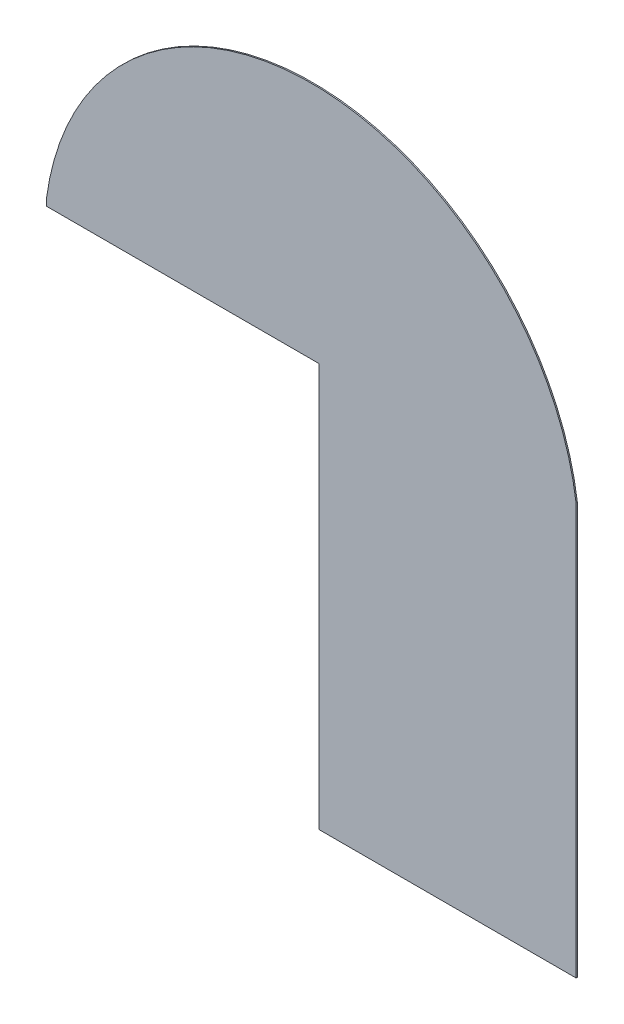
ISO-10303-21;
HEADER;
FILE_DESCRIPTION(('STEP AP214'),'2;1');
FILE_NAME('part.step','',(''),(''),'','','');
FILE_SCHEMA(('AUTOMOTIVE_DESIGN { 1 0 10303 214 1 1 1 1 }'));
ENDSEC;
DATA;
#1=APPLICATION_CONTEXT('core data for automotive mechanical design processes');
#2=APPLICATION_PROTOCOL_DEFINITION('international standard','automotive_design',2000,#1);
#3=PRODUCT_CONTEXT('',#1,'mechanical');
#4=PRODUCT('Part','Part','',(#3));
#5=PRODUCT_RELATED_PRODUCT_CATEGORY('part','',(#4));
#6=PRODUCT_DEFINITION_FORMATION('','',#4);
#7=PRODUCT_DEFINITION_CONTEXT('part definition',#1,'design');
#8=PRODUCT_DEFINITION('design','',#6,#7);
#9=PRODUCT_DEFINITION_SHAPE('','',#8);
#10=(LENGTH_UNIT() NAMED_UNIT(*) SI_UNIT(.MILLI.,.METRE.));
#11=(NAMED_UNIT(*) PLANE_ANGLE_UNIT() SI_UNIT($,.RADIAN.));
#12=(NAMED_UNIT(*) SI_UNIT($,.STERADIAN.) SOLID_ANGLE_UNIT());
#13=UNCERTAINTY_MEASURE_WITH_UNIT(LENGTH_MEASURE(1.E-05),#10,'distance_accuracy_value','');
#14=(GEOMETRIC_REPRESENTATION_CONTEXT(3) GLOBAL_UNCERTAINTY_ASSIGNED_CONTEXT((#13)) GLOBAL_UNIT_ASSIGNED_CONTEXT((#10,
#11,#12)) REPRESENTATION_CONTEXT('',''));
#15=CARTESIAN_POINT('',(0.,0.,0.));
#16=DIRECTION('',(0.,0.,1.));
#17=DIRECTION('',(1.,0.,0.));
#18=AXIS2_PLACEMENT_3D('',#15,#16,#17);
#19=CARTESIAN_POINT('',(-1030.,800.000000000001,2.5));
#20=DIRECTION('',(1.,0.,0.));
#21=DIRECTION('',(0.,0.,-1.));
#22=AXIS2_PLACEMENT_3D('',#19,#20,#21);
#23=PLANE('',#22);
#24=DIRECTION('',(0.,0.,1.));
#25=VECTOR('',#24,1.);
#26=CARTESIAN_POINT('',(-1030.,770.000000000001,-2.5));
#27=LINE('',#26,#25);
#28=CARTESIAN_POINT('',(-1030.,770.000000000001,-2.5));
#29=VERTEX_POINT('',#28);
#30=CARTESIAN_POINT('',(-1030.,770.000000000001,2.5));
#31=VERTEX_POINT('',#30);
#32=EDGE_CURVE('E101',#29,#31,#27,.T.);
#33=ORIENTED_EDGE('',*,*,#32,.T.);
#34=DIRECTION('',(0.,-1.,0.));
#35=VECTOR('',#34,1.);
#36=CARTESIAN_POINT('',(-1030.,800.000000000001,2.5));
#37=LINE('',#36,#35);
#38=CARTESIAN_POINT('',(-1030.,800.000000000001,2.5));
#39=VERTEX_POINT('',#38);
#40=EDGE_CURVE('E139',#39,#31,#37,.T.);
#41=ORIENTED_EDGE('',*,*,#40,.F.);
#42=DIRECTION('',(0.,0.,-1.));
#43=VECTOR('',#42,1.);
#44=CARTESIAN_POINT('',(-1030.,800.000000000001,2.5));
#45=LINE('',#44,#43);
#46=CARTESIAN_POINT('',(-1030.,800.000000000001,-2.5));
#47=VERTEX_POINT('',#46);
#48=EDGE_CURVE('E123',#39,#47,#45,.T.);
#49=ORIENTED_EDGE('',*,*,#48,.T.);
#50=DIRECTION('',(0.,-1.,0.));
#51=VECTOR('',#50,1.);
#52=CARTESIAN_POINT('',(-1030.,800.000000000001,-2.5));
#53=LINE('',#52,#51);
#54=EDGE_CURVE('E118',#47,#29,#53,.T.);
#55=ORIENTED_EDGE('',*,*,#54,.T.);
#56=EDGE_LOOP('',(#33,#41,#49,#55));
#57=FACE_BOUND('',#56,.T.);
#58=ADVANCED_FACE('F39',(#57),#23,.F.);
#59=CARTESIAN_POINT('',(1030.,-799.999999999999,2.5));
#60=DIRECTION('',(0.,1.,0.));
#61=DIRECTION('',(0.,0.,1.));
#62=AXIS2_PLACEMENT_3D('',#59,#60,#61);
#63=PLANE('',#62);
#64=DIRECTION('',(0.,0.,1.));
#65=VECTOR('',#64,1.);
#66=CARTESIAN_POINT('',(30.0000000000002,-799.999999999999,-2.5));
#67=LINE('',#66,#65);
#68=CARTESIAN_POINT('',(30.0000000000002,-799.999999999999,-2.5));
#69=VERTEX_POINT('',#68);
#70=CARTESIAN_POINT('',(30.0000000000002,-799.999999999999,2.5));
#71=VERTEX_POINT('',#70);
#72=EDGE_CURVE('E112',#69,#71,#67,.T.);
#73=ORIENTED_EDGE('',*,*,#72,.F.);
#74=DIRECTION('',(1.,0.,0.));
#75=VECTOR('',#74,1.);
#76=CARTESIAN_POINT('',(1030.,-799.999999999999,-2.5));
#77=LINE('',#76,#75);
#78=CARTESIAN_POINT('',(1030.,-799.999999999999,-2.5));
#79=VERTEX_POINT('',#78);
#80=EDGE_CURVE('E125',#69,#79,#77,.T.);
#81=ORIENTED_EDGE('',*,*,#80,.T.);
#82=DIRECTION('',(0.,0.,-1.));
#83=VECTOR('',#82,1.);
#84=CARTESIAN_POINT('',(1030.,-799.999999999999,2.5));
#85=LINE('',#84,#83);
#86=CARTESIAN_POINT('',(1030.,-799.999999999999,2.5));
#87=VERTEX_POINT('',#86);
#88=EDGE_CURVE('E11',#87,#79,#85,.T.);
#89=ORIENTED_EDGE('',*,*,#88,.F.);
#90=DIRECTION('',(1.,0.,0.));
#91=VECTOR('',#90,1.);
#92=CARTESIAN_POINT('',(1030.,-799.999999999999,2.5));
#93=LINE('',#92,#91);
#94=EDGE_CURVE('E85',#71,#87,#93,.T.);
#95=ORIENTED_EDGE('',*,*,#94,.F.);
#96=EDGE_LOOP('',(#73,#81,#89,#95));
#97=FACE_BOUND('',#96,.T.);
#98=ADVANCED_FACE('F151',(#97),#63,.F.);
#99=CARTESIAN_POINT('',(0.,660.611111111113,2.5));
#100=DIRECTION('',(0.,0.,-1.));
#101=DIRECTION('',(-1.,0.,0.));
#102=AXIS2_PLACEMENT_3D('',#99,#100,#101);
#103=PLANE('',#102);
#104=DIRECTION('',(1.,0.,0.));
#105=VECTOR('',#104,1.);
#106=CARTESIAN_POINT('',(0.,770.000000000001,2.5));
#107=LINE('',#106,#105);
#108=CARTESIAN_POINT('',(30.0000000000002,770.000000000001,2.5));
#109=VERTEX_POINT('',#108);
#110=EDGE_CURVE('E107',#31,#109,#107,.T.);
#111=ORIENTED_EDGE('',*,*,#110,.T.);
#112=DIRECTION('',(0.,-1.,0.));
#113=VECTOR('',#112,1.);
#114=CARTESIAN_POINT('',(30.0000000000002,0.,2.5));
#115=LINE('',#114,#113);
#116=EDGE_CURVE('E121',#109,#71,#115,.T.);
#117=ORIENTED_EDGE('',*,*,#116,.T.);
#118=ORIENTED_EDGE('',*,*,#94,.T.);
#119=DIRECTION('',(0.,1.,0.));
#120=VECTOR('',#119,1.);
#121=CARTESIAN_POINT('',(1030.,800.000000000001,2.5));
#122=LINE('',#121,#120);
#123=CARTESIAN_POINT('',(1030.,800.000000000001,2.5));
#124=VERTEX_POINT('',#123);
#125=EDGE_CURVE('E148',#87,#124,#122,.T.);
#126=ORIENTED_EDGE('',*,*,#125,.T.);
#127=CARTESIAN_POINT('',(0.,660.611111111113,2.5));
#128=DIRECTION('',(0.,0.,1.));
#129=DIRECTION('',(-1.,0.,0.));
#130=AXIS2_PLACEMENT_3D('',#127,#128,#129);
#131=CIRCLE('',#130,1039.38888888889);
#132=EDGE_CURVE('E63',#124,#39,#131,.T.);
#133=ORIENTED_EDGE('',*,*,#132,.T.);
#134=ORIENTED_EDGE('',*,*,#40,.T.);
#135=EDGE_LOOP('',(#111,#117,#118,#126,#133,#134));
#136=FACE_BOUND('',#135,.T.);
#137=ADVANCED_FACE('F161',(#136),#103,.F.);
#138=CARTESIAN_POINT('',(0.,660.611111111113,-2.5));
#139=DIRECTION('',(0.,0.,-1.));
#140=DIRECTION('',(-1.,0.,0.));
#141=AXIS2_PLACEMENT_3D('',#138,#139,#140);
#142=PLANE('',#141);
#143=DIRECTION('',(0.,-1.,0.));
#144=VECTOR('',#143,1.);
#145=CARTESIAN_POINT('',(30.0000000000002,0.,-2.5));
#146=LINE('',#145,#144);
#147=CARTESIAN_POINT('',(30.0000000000002,770.000000000001,-2.5));
#148=VERTEX_POINT('',#147);
#149=EDGE_CURVE('E113',#148,#69,#146,.T.);
#150=ORIENTED_EDGE('',*,*,#149,.F.);
#151=DIRECTION('',(1.,0.,0.));
#152=VECTOR('',#151,1.);
#153=CARTESIAN_POINT('',(0.,770.000000000001,-2.5));
#154=LINE('',#153,#152);
#155=EDGE_CURVE('E104',#29,#148,#154,.T.);
#156=ORIENTED_EDGE('',*,*,#155,.F.);
#157=ORIENTED_EDGE('',*,*,#54,.F.);
#158=CARTESIAN_POINT('',(0.,660.611111111113,-2.5));
#159=DIRECTION('',(0.,0.,1.));
#160=DIRECTION('',(-1.,0.,0.));
#161=AXIS2_PLACEMENT_3D('',#158,#159,#160);
#162=CIRCLE('',#161,1039.38888888889);
#163=CARTESIAN_POINT('',(1030.,800.000000000001,-2.5));
#164=VERTEX_POINT('',#163);
#165=EDGE_CURVE('E80',#164,#47,#162,.T.);
#166=ORIENTED_EDGE('',*,*,#165,.F.);
#167=DIRECTION('',(0.,1.,0.));
#168=VECTOR('',#167,1.);
#169=CARTESIAN_POINT('',(1030.,800.000000000001,-2.5));
#170=LINE('',#169,#168);
#171=EDGE_CURVE('E129',#79,#164,#170,.T.);
#172=ORIENTED_EDGE('',*,*,#171,.F.);
#173=ORIENTED_EDGE('',*,*,#80,.F.);
#174=EDGE_LOOP('',(#150,#156,#157,#166,#172,#173));
#175=FACE_BOUND('',#174,.T.);
#176=ADVANCED_FACE('F117',(#175),#142,.T.);
#177=CARTESIAN_POINT('',(1030.,800.000000000001,2.5));
#178=DIRECTION('',(-1.,0.,0.));
#179=DIRECTION('',(0.,-1.,0.));
#180=AXIS2_PLACEMENT_3D('',#177,#178,#179);
#181=PLANE('',#180);
#182=ORIENTED_EDGE('',*,*,#171,.T.);
#183=DIRECTION('',(0.,0.,-1.));
#184=VECTOR('',#183,1.);
#185=CARTESIAN_POINT('',(1030.,800.000000000001,2.5));
#186=LINE('',#185,#184);
#187=EDGE_CURVE('E47',#124,#164,#186,.T.);
#188=ORIENTED_EDGE('',*,*,#187,.F.);
#189=ORIENTED_EDGE('',*,*,#125,.F.);
#190=ORIENTED_EDGE('',*,*,#88,.T.);
#191=EDGE_LOOP('',(#182,#188,#189,#190));
#192=FACE_BOUND('',#191,.T.);
#193=ADVANCED_FACE('F147',(#192),#181,.F.);
#194=CARTESIAN_POINT('',(0.,660.611111111113,2.5));
#195=DIRECTION('',(0.,0.,-1.));
#196=DIRECTION('',(-1.,0.,0.));
#197=AXIS2_PLACEMENT_3D('',#194,#195,#196);
#198=CYLINDRICAL_SURFACE('',#197,1039.38888888889);
#199=ORIENTED_EDGE('',*,*,#165,.T.);
#200=ORIENTED_EDGE('',*,*,#48,.F.);
#201=ORIENTED_EDGE('',*,*,#132,.F.);
#202=ORIENTED_EDGE('',*,*,#187,.T.);
#203=EDGE_LOOP('',(#199,#200,#201,#202));
#204=FACE_BOUND('',#203,.T.);
#205=ADVANCED_FACE('F143',(#204),#198,.T.);
#206=CARTESIAN_POINT('',(0.,770.000000000001,-2.5));
#207=DIRECTION('',(0.,-1.,0.));
#208=DIRECTION('',(0.,0.,-1.));
#209=AXIS2_PLACEMENT_3D('',#206,#207,#208);
#210=PLANE('',#209);
#211=ORIENTED_EDGE('',*,*,#110,.F.);
#212=ORIENTED_EDGE('',*,*,#32,.F.);
#213=ORIENTED_EDGE('',*,*,#155,.T.);
#214=DIRECTION('',(0.,0.,1.));
#215=VECTOR('',#214,1.);
#216=CARTESIAN_POINT('',(30.0000000000002,770.000000000001,-2.5));
#217=LINE('',#216,#215);
#218=EDGE_CURVE('E54',#148,#109,#217,.T.);
#219=ORIENTED_EDGE('',*,*,#218,.T.);
#220=EDGE_LOOP('',(#211,#212,#213,#219));
#221=FACE_BOUND('',#220,.T.);
#222=ADVANCED_FACE('F103',(#221),#210,.T.);
#223=CARTESIAN_POINT('',(30.0000000000002,0.,-2.5));
#224=DIRECTION('',(-1.,0.,0.));
#225=DIRECTION('',(0.,0.,1.));
#226=AXIS2_PLACEMENT_3D('',#223,#224,#225);
#227=PLANE('',#226);
#228=ORIENTED_EDGE('',*,*,#116,.F.);
#229=ORIENTED_EDGE('',*,*,#218,.F.);
#230=ORIENTED_EDGE('',*,*,#149,.T.);
#231=ORIENTED_EDGE('',*,*,#72,.T.);
#232=EDGE_LOOP('',(#228,#229,#230,#231));
#233=FACE_BOUND('',#232,.T.);
#234=ADVANCED_FACE('F199',(#233),#227,.T.);
#235=CLOSED_SHELL('',(#58,#98,#137,#176,#193,#205,#222,#234));
#236=MANIFOLD_SOLID_BREP('B2',#235);
#237=ADVANCED_BREP_SHAPE_REPRESENTATION('',(#18,#236),#14);
#238=SHAPE_DEFINITION_REPRESENTATION(#9,#237);
ENDSEC;
END-ISO-10303-21;
